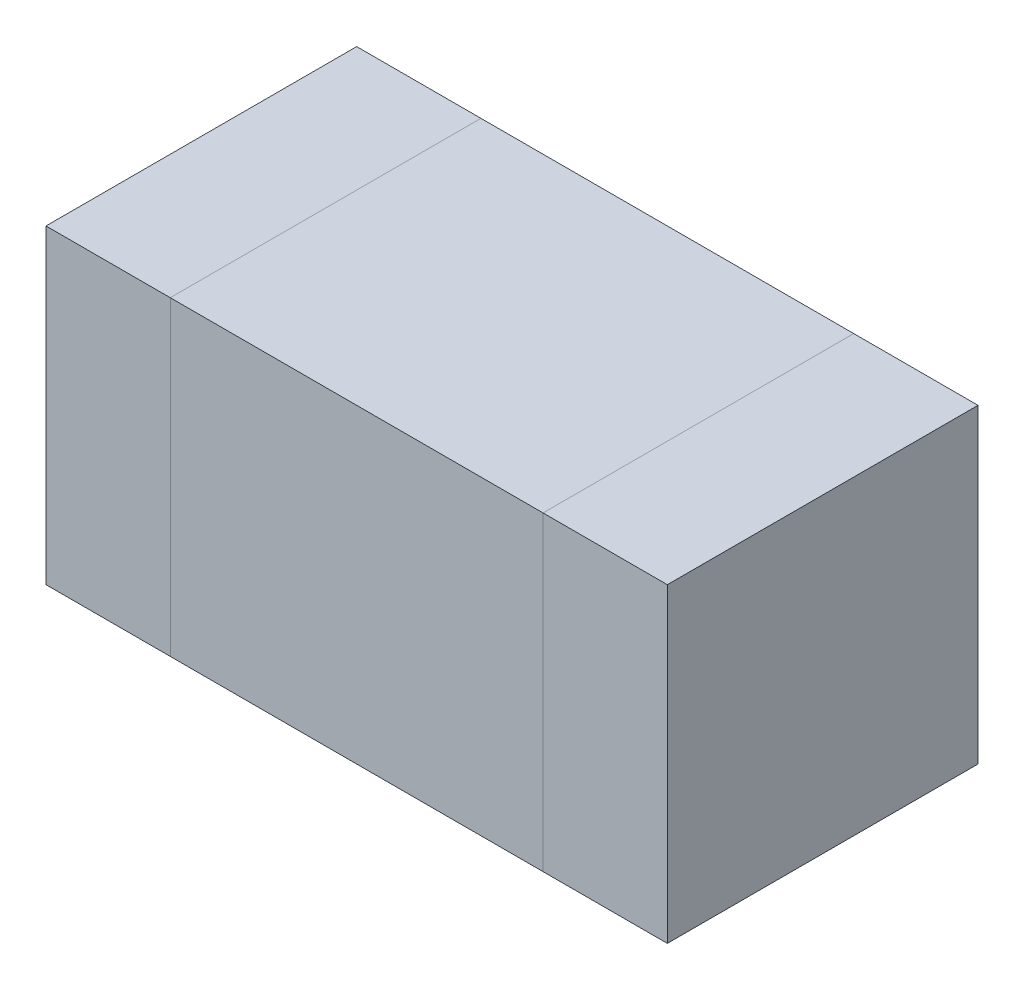
ISO-10303-21;
HEADER;
FILE_DESCRIPTION(('STEP AP214'),'2;1');
FILE_NAME('part.step','',(''),(''),'','','');
FILE_SCHEMA(('AUTOMOTIVE_DESIGN { 1 0 10303 214 1 1 1 1 }'));
ENDSEC;
DATA;
#1=APPLICATION_CONTEXT('core data for automotive mechanical design processes');
#2=APPLICATION_PROTOCOL_DEFINITION('international standard','automotive_design',2000,#1);
#3=PRODUCT_CONTEXT('',#1,'mechanical');
#4=PRODUCT('Part','Part','',(#3));
#5=PRODUCT_RELATED_PRODUCT_CATEGORY('part','',(#4));
#6=PRODUCT_DEFINITION_FORMATION('','',#4);
#7=PRODUCT_DEFINITION_CONTEXT('part definition',#1,'design');
#8=PRODUCT_DEFINITION('design','',#6,#7);
#9=PRODUCT_DEFINITION_SHAPE('','',#8);
#10=(LENGTH_UNIT() NAMED_UNIT(*) SI_UNIT(.MILLI.,.METRE.));
#11=(NAMED_UNIT(*) PLANE_ANGLE_UNIT() SI_UNIT($,.RADIAN.));
#12=(NAMED_UNIT(*) SI_UNIT($,.STERADIAN.) SOLID_ANGLE_UNIT());
#13=UNCERTAINTY_MEASURE_WITH_UNIT(LENGTH_MEASURE(1.E-05),#10,'distance_accuracy_value','');
#14=(GEOMETRIC_REPRESENTATION_CONTEXT(3) GLOBAL_UNCERTAINTY_ASSIGNED_CONTEXT((#13)) GLOBAL_UNIT_ASSIGNED_CONTEXT((#10,
#11,#12)) REPRESENTATION_CONTEXT('',''));
#15=CARTESIAN_POINT('',(0.,0.,0.));
#16=DIRECTION('',(0.,0.,1.));
#17=DIRECTION('',(1.,0.,0.));
#18=AXIS2_PLACEMENT_3D('',#15,#16,#17);
#19=CARTESIAN_POINT('',(0.3,0.3,0.));
#20=DIRECTION('',(1.,0.,0.));
#21=DIRECTION('',(0.,0.,-1.));
#22=AXIS2_PLACEMENT_3D('',#19,#20,#21);
#23=PLANE('',#22);
#24=DIRECTION('',(0.,0.,1.));
#25=VECTOR('',#24,1.);
#26=CARTESIAN_POINT('',(0.3,0.3,0.));
#27=LINE('',#26,#25);
#28=CARTESIAN_POINT('',(0.3,0.3,0.15));
#29=VERTEX_POINT('',#28);
#30=CARTESIAN_POINT('',(0.3,0.3,-0.15));
#31=VERTEX_POINT('',#30);
#32=EDGE_CURVE('P0_E54',#29,#31,#27,.F.);
#33=ORIENTED_EDGE('',*,*,#32,.F.);
#34=DIRECTION('',(0.,1.,0.));
#35=VECTOR('',#34,1.);
#36=CARTESIAN_POINT('',(0.3,0.3,0.15));
#37=LINE('',#36,#35);
#38=CARTESIAN_POINT('',(0.3,0.,0.15));
#39=VERTEX_POINT('',#38);
#40=EDGE_CURVE('P0_E73',#29,#39,#37,.F.);
#41=ORIENTED_EDGE('',*,*,#40,.T.);
#42=DIRECTION('',(0.,0.,1.));
#43=VECTOR('',#42,1.);
#44=CARTESIAN_POINT('',(0.3,0.,0.));
#45=LINE('',#44,#43);
#46=CARTESIAN_POINT('',(0.3,0.,-0.15));
#47=VERTEX_POINT('',#46);
#48=EDGE_CURVE('P0_E65',#39,#47,#45,.F.);
#49=ORIENTED_EDGE('',*,*,#48,.T.);
#50=DIRECTION('',(0.,1.,0.));
#51=VECTOR('',#50,1.);
#52=CARTESIAN_POINT('',(0.3,0.3,-0.15));
#53=LINE('',#52,#51);
#54=EDGE_CURVE('P0_E19',#31,#47,#53,.F.);
#55=ORIENTED_EDGE('',*,*,#54,.F.);
#56=EDGE_LOOP('',(#33,#41,#49,#55));
#57=FACE_BOUND('',#56,.T.);
#58=ADVANCED_FACE('P0_F16',(#57),#23,.T.);
#59=CARTESIAN_POINT('',(0.,0.3,-0.15));
#60=DIRECTION('',(0.,0.,-1.));
#61=DIRECTION('',(-1.,0.,0.));
#62=AXIS2_PLACEMENT_3D('',#59,#60,#61);
#63=PLANE('',#62);
#64=DIRECTION('',(1.,0.,0.));
#65=VECTOR('',#64,1.);
#66=CARTESIAN_POINT('',(0.,0.3,-0.15));
#67=LINE('',#66,#65);
#68=CARTESIAN_POINT('',(0.18,0.3,-0.15));
#69=VERTEX_POINT('',#68);
#70=EDGE_CURVE('P0_E61',#31,#69,#67,.F.);
#71=ORIENTED_EDGE('',*,*,#70,.F.);
#72=ORIENTED_EDGE('',*,*,#54,.T.);
#73=DIRECTION('',(1.,0.,0.));
#74=VECTOR('',#73,1.);
#75=CARTESIAN_POINT('',(0.,0.,-0.15));
#76=LINE('',#75,#74);
#77=CARTESIAN_POINT('',(0.18,0.,-0.15));
#78=VERTEX_POINT('',#77);
#79=EDGE_CURVE('P0_E77',#47,#78,#76,.F.);
#80=ORIENTED_EDGE('',*,*,#79,.T.);
#81=DIRECTION('',(0.,1.,0.));
#82=VECTOR('',#81,1.);
#83=CARTESIAN_POINT('',(0.18,0.3,-0.15));
#84=LINE('',#83,#82);
#85=EDGE_CURVE('P0_E71',#78,#69,#84,.T.);
#86=ORIENTED_EDGE('',*,*,#85,.T.);
#87=EDGE_LOOP('',(#71,#72,#80,#86));
#88=FACE_BOUND('',#87,.T.);
#89=ADVANCED_FACE('P0_F70',(#88),#63,.T.);
#90=CARTESIAN_POINT('',(0.,0.3,0.));
#91=DIRECTION('',(0.,1.,0.));
#92=DIRECTION('',(0.,0.,1.));
#93=AXIS2_PLACEMENT_3D('',#90,#91,#92);
#94=PLANE('',#93);
#95=DIRECTION('',(0.,0.,-1.));
#96=VECTOR('',#95,1.);
#97=CARTESIAN_POINT('',(0.18,0.3,0.));
#98=LINE('',#97,#96);
#99=CARTESIAN_POINT('',(0.18,0.3,0.15));
#100=VERTEX_POINT('',#99);
#101=EDGE_CURVE('P0_E82',#69,#100,#98,.F.);
#102=ORIENTED_EDGE('',*,*,#101,.T.);
#103=DIRECTION('',(-1.,0.,0.));
#104=VECTOR('',#103,1.);
#105=CARTESIAN_POINT('',(0.,0.3,0.15));
#106=LINE('',#105,#104);
#107=EDGE_CURVE('P0_E63',#100,#29,#106,.F.);
#108=ORIENTED_EDGE('',*,*,#107,.T.);
#109=ORIENTED_EDGE('',*,*,#32,.T.);
#110=ORIENTED_EDGE('',*,*,#70,.T.);
#111=EDGE_LOOP('',(#102,#108,#109,#110));
#112=FACE_BOUND('',#111,.T.);
#113=ADVANCED_FACE('P0_F59',(#112),#94,.T.);
#114=CARTESIAN_POINT('',(0.,0.3,0.15));
#115=DIRECTION('',(0.,0.,-1.));
#116=DIRECTION('',(-1.,0.,0.));
#117=AXIS2_PLACEMENT_3D('',#114,#115,#116);
#118=PLANE('',#117);
#119=ORIENTED_EDGE('',*,*,#40,.F.);
#120=ORIENTED_EDGE('',*,*,#107,.F.);
#121=DIRECTION('',(0.,1.,0.));
#122=VECTOR('',#121,1.);
#123=CARTESIAN_POINT('',(0.18,0.3,0.15));
#124=LINE('',#123,#122);
#125=CARTESIAN_POINT('',(0.18,0.,0.15));
#126=VERTEX_POINT('',#125);
#127=EDGE_CURVE('P0_E25',#100,#126,#124,.F.);
#128=ORIENTED_EDGE('',*,*,#127,.T.);
#129=DIRECTION('',(1.,0.,0.));
#130=VECTOR('',#129,1.);
#131=CARTESIAN_POINT('',(0.,0.,0.15));
#132=LINE('',#131,#130);
#133=EDGE_CURVE('P0_E33',#126,#39,#132,.T.);
#134=ORIENTED_EDGE('',*,*,#133,.T.);
#135=EDGE_LOOP('',(#119,#120,#128,#134));
#136=FACE_BOUND('',#135,.T.);
#137=ADVANCED_FACE('P0_F87',(#136),#118,.F.);
#138=CARTESIAN_POINT('',(0.,0.,0.));
#139=DIRECTION('',(0.,1.,0.));
#140=DIRECTION('',(0.,0.,1.));
#141=AXIS2_PLACEMENT_3D('',#138,#139,#140);
#142=PLANE('',#141);
#143=ORIENTED_EDGE('',*,*,#133,.F.);
#144=DIRECTION('',(0.,0.,-1.));
#145=VECTOR('',#144,1.);
#146=CARTESIAN_POINT('',(0.18,0.,0.));
#147=LINE('',#146,#145);
#148=EDGE_CURVE('P0_E11',#126,#78,#147,.T.);
#149=ORIENTED_EDGE('',*,*,#148,.T.);
#150=ORIENTED_EDGE('',*,*,#79,.F.);
#151=ORIENTED_EDGE('',*,*,#48,.F.);
#152=EDGE_LOOP('',(#143,#149,#150,#151));
#153=FACE_BOUND('',#152,.T.);
#154=ADVANCED_FACE('P0_F90',(#153),#142,.F.);
#155=CARTESIAN_POINT('',(0.18,0.3,0.));
#156=DIRECTION('',(1.,0.,0.));
#157=DIRECTION('',(0.,0.,-1.));
#158=AXIS2_PLACEMENT_3D('',#155,#156,#157);
#159=PLANE('',#158);
#160=ORIENTED_EDGE('',*,*,#127,.F.);
#161=ORIENTED_EDGE('',*,*,#101,.F.);
#162=ORIENTED_EDGE('',*,*,#85,.F.);
#163=ORIENTED_EDGE('',*,*,#148,.F.);
#164=EDGE_LOOP('',(#160,#161,#162,#163));
#165=FACE_BOUND('',#164,.T.);
#166=ADVANCED_FACE('P0_F89',(#165),#159,.F.);
#167=CLOSED_SHELL('',(#58,#89,#113,#137,#154,#166));
#168=MANIFOLD_SOLID_BREP('P0_B1',#167);
#169=CARTESIAN_POINT('',(0.,0.,0.));
#170=DIRECTION('',(0.,1.,0.));
#171=DIRECTION('',(0.,0.,1.));
#172=AXIS2_PLACEMENT_3D('',#169,#170,#171);
#173=PLANE('',#172);
#174=DIRECTION('',(0.,0.,-1.));
#175=VECTOR('',#174,1.);
#176=CARTESIAN_POINT('',(-0.18,0.,0.));
#177=LINE('',#176,#175);
#178=CARTESIAN_POINT('',(-0.18,0.,0.15));
#179=VERTEX_POINT('',#178);
#180=CARTESIAN_POINT('',(-0.18,0.,-0.15));
#181=VERTEX_POINT('',#180);
#182=EDGE_CURVE('P1_E80',#179,#181,#177,.T.);
#183=ORIENTED_EDGE('',*,*,#182,.T.);
#184=DIRECTION('',(-1.,0.,0.));
#185=VECTOR('',#184,1.);
#186=CARTESIAN_POINT('',(0.,0.,-0.15));
#187=LINE('',#186,#185);
#188=CARTESIAN_POINT('',(0.18,0.,-0.15));
#189=VERTEX_POINT('',#188);
#190=EDGE_CURVE('P1_E54',#189,#181,#187,.T.);
#191=ORIENTED_EDGE('',*,*,#190,.F.);
#192=DIRECTION('',(0.,0.,-1.));
#193=VECTOR('',#192,1.);
#194=CARTESIAN_POINT('',(0.18,0.,0.));
#195=LINE('',#194,#193);
#196=CARTESIAN_POINT('',(0.18,0.,0.15));
#197=VERTEX_POINT('',#196);
#198=EDGE_CURVE('P1_E56',#197,#189,#195,.T.);
#199=ORIENTED_EDGE('',*,*,#198,.F.);
#200=DIRECTION('',(-1.,0.,0.));
#201=VECTOR('',#200,1.);
#202=CARTESIAN_POINT('',(0.,0.,0.15));
#203=LINE('',#202,#201);
#204=EDGE_CURVE('P1_E19',#197,#179,#203,.T.);
#205=ORIENTED_EDGE('',*,*,#204,.T.);
#206=EDGE_LOOP('',(#183,#191,#199,#205));
#207=FACE_BOUND('',#206,.T.);
#208=ADVANCED_FACE('P1_F16',(#207),#173,.F.);
#209=CARTESIAN_POINT('',(0.,0.3,0.15));
#210=DIRECTION('',(0.,0.,-1.));
#211=DIRECTION('',(-1.,0.,0.));
#212=AXIS2_PLACEMENT_3D('',#209,#210,#211);
#213=PLANE('',#212);
#214=DIRECTION('',(0.,1.,0.));
#215=VECTOR('',#214,1.);
#216=CARTESIAN_POINT('',(0.18,0.3,0.15));
#217=LINE('',#216,#215);
#218=CARTESIAN_POINT('',(0.18,0.3,0.15));
#219=VERTEX_POINT('',#218);
#220=EDGE_CURVE('P1_E62',#219,#197,#217,.F.);
#221=ORIENTED_EDGE('',*,*,#220,.F.);
#222=DIRECTION('',(1.,0.,0.));
#223=VECTOR('',#222,1.);
#224=CARTESIAN_POINT('',(0.,0.3,0.15));
#225=LINE('',#224,#223);
#226=CARTESIAN_POINT('',(-0.18,0.3,0.15));
#227=VERTEX_POINT('',#226);
#228=EDGE_CURVE('P1_E82',#227,#219,#225,.T.);
#229=ORIENTED_EDGE('',*,*,#228,.F.);
#230=DIRECTION('',(0.,1.,0.));
#231=VECTOR('',#230,1.);
#232=CARTESIAN_POINT('',(-0.18,0.3,0.15));
#233=LINE('',#232,#231);
#234=EDGE_CURVE('P1_E67',#227,#179,#233,.F.);
#235=ORIENTED_EDGE('',*,*,#234,.T.);
#236=ORIENTED_EDGE('',*,*,#204,.F.);
#237=EDGE_LOOP('',(#221,#229,#235,#236));
#238=FACE_BOUND('',#237,.T.);
#239=ADVANCED_FACE('P1_F64',(#238),#213,.F.);
#240=CARTESIAN_POINT('',(0.18,0.3,0.));
#241=DIRECTION('',(1.,0.,0.));
#242=DIRECTION('',(0.,0.,-1.));
#243=AXIS2_PLACEMENT_3D('',#240,#241,#242);
#244=PLANE('',#243);
#245=DIRECTION('',(0.,0.,1.));
#246=VECTOR('',#245,1.);
#247=CARTESIAN_POINT('',(0.18,0.3,0.));
#248=LINE('',#247,#246);
#249=CARTESIAN_POINT('',(0.18,0.3,-0.15));
#250=VERTEX_POINT('',#249);
#251=EDGE_CURVE('P1_E71',#219,#250,#248,.F.);
#252=ORIENTED_EDGE('',*,*,#251,.F.);
#253=ORIENTED_EDGE('',*,*,#220,.T.);
#254=ORIENTED_EDGE('',*,*,#198,.T.);
#255=DIRECTION('',(0.,1.,0.));
#256=VECTOR('',#255,1.);
#257=CARTESIAN_POINT('',(0.18,0.3,-0.15));
#258=LINE('',#257,#256);
#259=EDGE_CURVE('P1_E74',#250,#189,#258,.F.);
#260=ORIENTED_EDGE('',*,*,#259,.F.);
#261=EDGE_LOOP('',(#252,#253,#254,#260));
#262=FACE_BOUND('',#261,.T.);
#263=ADVANCED_FACE('P1_F69',(#262),#244,.T.);
#264=CARTESIAN_POINT('',(0.,0.3,-0.15));
#265=DIRECTION('',(0.,0.,-1.));
#266=DIRECTION('',(-1.,0.,0.));
#267=AXIS2_PLACEMENT_3D('',#264,#265,#266);
#268=PLANE('',#267);
#269=DIRECTION('',(1.,0.,0.));
#270=VECTOR('',#269,1.);
#271=CARTESIAN_POINT('',(0.,0.3,-0.15));
#272=LINE('',#271,#270);
#273=CARTESIAN_POINT('',(-0.18,0.3,-0.15));
#274=VERTEX_POINT('',#273);
#275=EDGE_CURVE('P1_E25',#250,#274,#272,.F.);
#276=ORIENTED_EDGE('',*,*,#275,.F.);
#277=ORIENTED_EDGE('',*,*,#259,.T.);
#278=ORIENTED_EDGE('',*,*,#190,.T.);
#279=DIRECTION('',(0.,1.,0.));
#280=VECTOR('',#279,1.);
#281=CARTESIAN_POINT('',(-0.18,0.3,-0.15));
#282=LINE('',#281,#280);
#283=EDGE_CURVE('P1_E34',#181,#274,#282,.T.);
#284=ORIENTED_EDGE('',*,*,#283,.T.);
#285=EDGE_LOOP('',(#276,#277,#278,#284));
#286=FACE_BOUND('',#285,.T.);
#287=ADVANCED_FACE('P1_F88',(#286),#268,.T.);
#288=CARTESIAN_POINT('',(-0.18,0.3,0.));
#289=DIRECTION('',(1.,0.,0.));
#290=DIRECTION('',(0.,0.,-1.));
#291=AXIS2_PLACEMENT_3D('',#288,#289,#290);
#292=PLANE('',#291);
#293=ORIENTED_EDGE('',*,*,#234,.F.);
#294=DIRECTION('',(0.,0.,1.));
#295=VECTOR('',#294,1.);
#296=CARTESIAN_POINT('',(-0.18,0.3,0.));
#297=LINE('',#296,#295);
#298=EDGE_CURVE('P1_E11',#274,#227,#297,.T.);
#299=ORIENTED_EDGE('',*,*,#298,.F.);
#300=ORIENTED_EDGE('',*,*,#283,.F.);
#301=ORIENTED_EDGE('',*,*,#182,.F.);
#302=EDGE_LOOP('',(#293,#299,#300,#301));
#303=FACE_BOUND('',#302,.T.);
#304=ADVANCED_FACE('P1_F90',(#303),#292,.F.);
#305=CARTESIAN_POINT('',(0.,0.3,0.));
#306=DIRECTION('',(0.,1.,0.));
#307=DIRECTION('',(0.,0.,1.));
#308=AXIS2_PLACEMENT_3D('',#305,#306,#307);
#309=PLANE('',#308);
#310=ORIENTED_EDGE('',*,*,#275,.T.);
#311=ORIENTED_EDGE('',*,*,#298,.T.);
#312=ORIENTED_EDGE('',*,*,#228,.T.);
#313=ORIENTED_EDGE('',*,*,#251,.T.);
#314=EDGE_LOOP('',(#310,#311,#312,#313));
#315=FACE_BOUND('',#314,.T.);
#316=ADVANCED_FACE('P1_F87',(#315),#309,.T.);
#317=CLOSED_SHELL('',(#208,#239,#263,#287,#304,#316));
#318=MANIFOLD_SOLID_BREP('P1_B1',#317);
#319=CARTESIAN_POINT('',(-0.18,0.3,0.));
#320=DIRECTION('',(1.,0.,0.));
#321=DIRECTION('',(0.,0.,-1.));
#322=AXIS2_PLACEMENT_3D('',#319,#320,#321);
#323=PLANE('',#322);
#324=DIRECTION('',(0.,0.,1.));
#325=VECTOR('',#324,1.);
#326=CARTESIAN_POINT('',(-0.18,0.3,0.));
#327=LINE('',#326,#325);
#328=CARTESIAN_POINT('',(-0.18,0.3,0.15));
#329=VERTEX_POINT('',#328);
#330=CARTESIAN_POINT('',(-0.18,0.3,-0.15));
#331=VERTEX_POINT('',#330);
#332=EDGE_CURVE('P2_E58',#329,#331,#327,.F.);
#333=ORIENTED_EDGE('',*,*,#332,.F.);
#334=DIRECTION('',(0.,1.,0.));
#335=VECTOR('',#334,1.);
#336=CARTESIAN_POINT('',(-0.18,0.3,0.15));
#337=LINE('',#336,#335);
#338=CARTESIAN_POINT('',(-0.18,0.,0.15));
#339=VERTEX_POINT('',#338);
#340=EDGE_CURVE('P2_E52',#339,#329,#337,.T.);
#341=ORIENTED_EDGE('',*,*,#340,.F.);
#342=DIRECTION('',(0.,0.,1.));
#343=VECTOR('',#342,1.);
#344=CARTESIAN_POINT('',(-0.18,0.,0.));
#345=LINE('',#344,#343);
#346=CARTESIAN_POINT('',(-0.18,0.,-0.15));
#347=VERTEX_POINT('',#346);
#348=EDGE_CURVE('P2_E60',#339,#347,#345,.F.);
#349=ORIENTED_EDGE('',*,*,#348,.T.);
#350=DIRECTION('',(0.,1.,0.));
#351=VECTOR('',#350,1.);
#352=CARTESIAN_POINT('',(-0.18,0.3,-0.15));
#353=LINE('',#352,#351);
#354=EDGE_CURVE('P2_E19',#347,#331,#353,.T.);
#355=ORIENTED_EDGE('',*,*,#354,.T.);
#356=EDGE_LOOP('',(#333,#341,#349,#355));
#357=FACE_BOUND('',#356,.T.);
#358=ADVANCED_FACE('P2_F16',(#357),#323,.T.);
#359=CARTESIAN_POINT('',(0.,0.3,-0.15));
#360=DIRECTION('',(0.,0.,1.));
#361=DIRECTION('',(1.,0.,0.));
#362=AXIS2_PLACEMENT_3D('',#359,#360,#361);
#363=PLANE('',#362);
#364=DIRECTION('',(0.,1.,0.));
#365=VECTOR('',#364,1.);
#366=CARTESIAN_POINT('',(-0.3,0.3,-0.15));
#367=LINE('',#366,#365);
#368=CARTESIAN_POINT('',(-0.3,0.,-0.15));
#369=VERTEX_POINT('',#368);
#370=CARTESIAN_POINT('',(-0.3,0.3,-0.15));
#371=VERTEX_POINT('',#370);
#372=EDGE_CURVE('P2_E74',#369,#371,#367,.T.);
#373=ORIENTED_EDGE('',*,*,#372,.T.);
#374=DIRECTION('',(1.,0.,0.));
#375=VECTOR('',#374,1.);
#376=CARTESIAN_POINT('',(0.,0.3,-0.15));
#377=LINE('',#376,#375);
#378=EDGE_CURVE('P2_E65',#331,#371,#377,.F.);
#379=ORIENTED_EDGE('',*,*,#378,.F.);
#380=ORIENTED_EDGE('',*,*,#354,.F.);
#381=DIRECTION('',(1.,0.,0.));
#382=VECTOR('',#381,1.);
#383=CARTESIAN_POINT('',(0.,0.,-0.15));
#384=LINE('',#383,#382);
#385=EDGE_CURVE('P2_E80',#347,#369,#384,.F.);
#386=ORIENTED_EDGE('',*,*,#385,.T.);
#387=EDGE_LOOP('',(#373,#379,#380,#386));
#388=FACE_BOUND('',#387,.T.);
#389=ADVANCED_FACE('P2_F73',(#388),#363,.F.);
#390=CARTESIAN_POINT('',(0.,0.3,0.));
#391=DIRECTION('',(0.,1.,0.));
#392=DIRECTION('',(0.,0.,1.));
#393=AXIS2_PLACEMENT_3D('',#390,#391,#392);
#394=PLANE('',#393);
#395=DIRECTION('',(1.,0.,0.));
#396=VECTOR('',#395,1.);
#397=CARTESIAN_POINT('',(0.,0.3,0.15));
#398=LINE('',#397,#396);
#399=CARTESIAN_POINT('',(-0.3,0.3,0.15));
#400=VERTEX_POINT('',#399);
#401=EDGE_CURVE('P2_E70',#329,#400,#398,.F.);
#402=ORIENTED_EDGE('',*,*,#401,.F.);
#403=ORIENTED_EDGE('',*,*,#332,.T.);
#404=ORIENTED_EDGE('',*,*,#378,.T.);
#405=DIRECTION('',(0.,0.,-1.));
#406=VECTOR('',#405,1.);
#407=CARTESIAN_POINT('',(-0.3,0.3,0.));
#408=LINE('',#407,#406);
#409=EDGE_CURVE('P2_E83',#371,#400,#408,.F.);
#410=ORIENTED_EDGE('',*,*,#409,.T.);
#411=EDGE_LOOP('',(#402,#403,#404,#410));
#412=FACE_BOUND('',#411,.T.);
#413=ADVANCED_FACE('P2_F67',(#412),#394,.T.);
#414=CARTESIAN_POINT('',(0.,0.3,0.15));
#415=DIRECTION('',(0.,0.,1.));
#416=DIRECTION('',(1.,0.,0.));
#417=AXIS2_PLACEMENT_3D('',#414,#415,#416);
#418=PLANE('',#417);
#419=ORIENTED_EDGE('',*,*,#401,.T.);
#420=DIRECTION('',(0.,1.,0.));
#421=VECTOR('',#420,1.);
#422=CARTESIAN_POINT('',(-0.3,0.3,0.15));
#423=LINE('',#422,#421);
#424=CARTESIAN_POINT('',(-0.3,0.,0.15));
#425=VERTEX_POINT('',#424);
#426=EDGE_CURVE('P2_E25',#400,#425,#423,.F.);
#427=ORIENTED_EDGE('',*,*,#426,.T.);
#428=DIRECTION('',(1.,0.,0.));
#429=VECTOR('',#428,1.);
#430=CARTESIAN_POINT('',(0.,0.,0.15));
#431=LINE('',#430,#429);
#432=EDGE_CURVE('P2_E33',#425,#339,#431,.T.);
#433=ORIENTED_EDGE('',*,*,#432,.T.);
#434=ORIENTED_EDGE('',*,*,#340,.T.);
#435=EDGE_LOOP('',(#419,#427,#433,#434));
#436=FACE_BOUND('',#435,.T.);
#437=ADVANCED_FACE('P2_F87',(#436),#418,.T.);
#438=CARTESIAN_POINT('',(0.,0.,0.));
#439=DIRECTION('',(0.,1.,0.));
#440=DIRECTION('',(0.,0.,1.));
#441=AXIS2_PLACEMENT_3D('',#438,#439,#440);
#442=PLANE('',#441);
#443=ORIENTED_EDGE('',*,*,#348,.F.);
#444=ORIENTED_EDGE('',*,*,#432,.F.);
#445=DIRECTION('',(0.,0.,-1.));
#446=VECTOR('',#445,1.);
#447=CARTESIAN_POINT('',(-0.3,0.,0.));
#448=LINE('',#447,#446);
#449=EDGE_CURVE('P2_E11',#425,#369,#448,.T.);
#450=ORIENTED_EDGE('',*,*,#449,.T.);
#451=ORIENTED_EDGE('',*,*,#385,.F.);
#452=EDGE_LOOP('',(#443,#444,#450,#451));
#453=FACE_BOUND('',#452,.T.);
#454=ADVANCED_FACE('P2_F90',(#453),#442,.F.);
#455=CARTESIAN_POINT('',(-0.3,0.3,0.));
#456=DIRECTION('',(1.,0.,0.));
#457=DIRECTION('',(0.,0.,-1.));
#458=AXIS2_PLACEMENT_3D('',#455,#456,#457);
#459=PLANE('',#458);
#460=ORIENTED_EDGE('',*,*,#426,.F.);
#461=ORIENTED_EDGE('',*,*,#409,.F.);
#462=ORIENTED_EDGE('',*,*,#372,.F.);
#463=ORIENTED_EDGE('',*,*,#449,.F.);
#464=EDGE_LOOP('',(#460,#461,#462,#463));
#465=FACE_BOUND('',#464,.T.);
#466=ADVANCED_FACE('P2_F89',(#465),#459,.F.);
#467=CLOSED_SHELL('',(#358,#389,#413,#437,#454,#466));
#468=MANIFOLD_SOLID_BREP('P2_B1',#467);
#469=ADVANCED_BREP_SHAPE_REPRESENTATION('',(#18,#168,#318,#468),#14);
#470=SHAPE_DEFINITION_REPRESENTATION(#9,#469);
ENDSEC;
END-ISO-10303-21;
